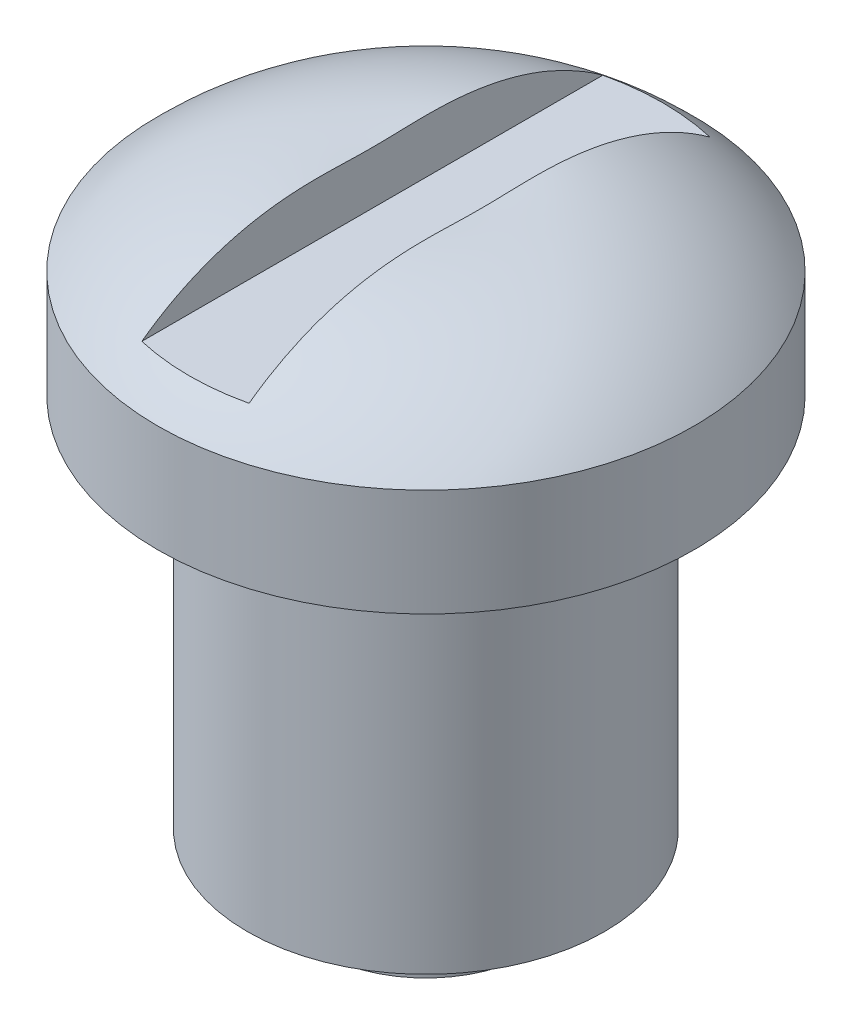
ISO-10303-21;
HEADER;
FILE_DESCRIPTION(('STEP AP214'),'2;1');
FILE_NAME('part.step','',(''),(''),'','','');
FILE_SCHEMA(('AUTOMOTIVE_DESIGN { 1 0 10303 214 1 1 1 1 }'));
ENDSEC;
DATA;
#1=APPLICATION_CONTEXT('core data for automotive mechanical design processes');
#2=APPLICATION_PROTOCOL_DEFINITION('international standard','automotive_design',2000,#1);
#3=PRODUCT_CONTEXT('',#1,'mechanical');
#4=PRODUCT('Part','Part','',(#3));
#5=PRODUCT_RELATED_PRODUCT_CATEGORY('part','',(#4));
#6=PRODUCT_DEFINITION_FORMATION('','',#4);
#7=PRODUCT_DEFINITION_CONTEXT('part definition',#1,'design');
#8=PRODUCT_DEFINITION('design','',#6,#7);
#9=PRODUCT_DEFINITION_SHAPE('','',#8);
#10=(LENGTH_UNIT() NAMED_UNIT(*) SI_UNIT(.MILLI.,.METRE.));
#11=(NAMED_UNIT(*) PLANE_ANGLE_UNIT() SI_UNIT($,.RADIAN.));
#12=(NAMED_UNIT(*) SI_UNIT($,.STERADIAN.) SOLID_ANGLE_UNIT());
#13=UNCERTAINTY_MEASURE_WITH_UNIT(LENGTH_MEASURE(1.E-05),#10,'distance_accuracy_value','');
#14=(GEOMETRIC_REPRESENTATION_CONTEXT(3) GLOBAL_UNCERTAINTY_ASSIGNED_CONTEXT((#13)) GLOBAL_UNIT_ASSIGNED_CONTEXT((#10,
#11,#12)) REPRESENTATION_CONTEXT('',''));
#15=CARTESIAN_POINT('',(0.,0.,0.));
#16=DIRECTION('',(0.,0.,1.));
#17=DIRECTION('',(1.,0.,0.));
#18=AXIS2_PLACEMENT_3D('',#15,#16,#17);
#19=CARTESIAN_POINT('',(0.,1.51705678998902,0.));
#20=DIRECTION('',(0.,1.,0.));
#21=DIRECTION('',(0.,0.,1.));
#22=AXIS2_PLACEMENT_3D('',#19,#20,#21);
#23=DEGENERATE_TOROIDAL_SURFACE('',#22,1.41264629624588,5.,.T.);
#24=CARTESIAN_POINT('',(0.,5.,0.));
#25=DIRECTION('',(0.,1.,0.));
#26=DIRECTION('',(0.,0.,1.));
#27=AXIS2_PLACEMENT_3D('',#24,#25,#26);
#28=CIRCLE('',#27,5.);
#29=CARTESIAN_POINT('',(0.,5.,5.));
#30=VERTEX_POINT('',#29);
#31=EDGE_CURVE('E116',#30,#30,#28,.T.);
#32=ORIENTED_EDGE('',*,*,#31,.T.);
#33=EDGE_LOOP('',(#32));
#34=FACE_BOUND('',#33,.T.);
#35=CARTESIAN_POINT('',(1.,6.5,0.));
#36=CARTESIAN_POINT('',(1.,6.50000428929014,0.083420987186383));
#37=CARTESIAN_POINT('',(1.,6.50091310297412,0.166842031422464));
#38=CARTESIAN_POINT('',(1.,6.50400245623837,0.333672205487057));
#39=CARTESIAN_POINT('',(1.,6.50618325215456,0.417081329523434));
#40=CARTESIAN_POINT('',(1.,6.51058483821947,0.584013033033165));
#41=CARTESIAN_POINT('',(1.,6.51280567926023,0.667535610733787));
#42=CARTESIAN_POINT('',(1.,6.51605751929749,0.834607283332902));
#43=CARTESIAN_POINT('',(1.,6.51708854501698,0.918156377593679));
#44=CARTESIAN_POINT('',(1.,6.51702292300932,1.08672704487177));
#45=CARTESIAN_POINT('',(1.,6.51588861978802,1.17174872840559));
#46=CARTESIAN_POINT('',(1.,6.51074182722729,1.34171022124032));
#47=CARTESIAN_POINT('',(1.,6.50672935289437,1.42665003096579));
#48=CARTESIAN_POINT('',(1.,6.49538222680373,1.5963096749203));
#49=CARTESIAN_POINT('',(1.,6.48804775011912,1.68102952050507));
#50=CARTESIAN_POINT('',(1.,6.46977557954379,1.85008043325664));
#51=CARTESIAN_POINT('',(1.,6.45883769193728,1.93441147927476));
#52=CARTESIAN_POINT('',(1.,6.42037633974167,2.18623094475183));
#53=CARTESIAN_POINT('',(1.,6.38718339972831,2.35289941171905));
#54=CARTESIAN_POINT('',(1.,6.30500975311721,2.68231674629734));
#55=CARTESIAN_POINT('',(1.,6.25602821462935,2.84506540689087));
#56=CARTESIAN_POINT('',(1.,6.15165988503754,3.13863060855104));
#57=CARTESIAN_POINT('',(1.,6.09865173744313,3.27029641792875));
#58=CARTESIAN_POINT('',(1.,5.98182142398355,3.52879260778567));
#59=CARTESIAN_POINT('',(1.,5.91799636284731,3.65562168249405));
#60=CARTESIAN_POINT('',(1.,5.77981528879062,3.90359825368464));
#61=CARTESIAN_POINT('',(1.,5.70544734443971,4.02473910311308));
#62=CARTESIAN_POINT('',(1.,5.54667507092116,4.2603208674841));
#63=CARTESIAN_POINT('',(1.,5.46226714474613,4.37475935913765));
#64=CARTESIAN_POINT('',(1.,5.28400238202402,4.59603141971411));
#65=CARTESIAN_POINT('',(1.,5.1901452372631,4.70286474037801));
#66=CARTESIAN_POINT('',(1.,4.99360392788067,4.90815590142623));
#67=CARTESIAN_POINT('',(1.,4.89091645482418,5.00661057487586));
#68=CARTESIAN_POINT('',(1.,4.67758264573563,5.19426483768728));
#69=CARTESIAN_POINT('',(1.,4.56694411938434,5.28347330402824));
#70=CARTESIAN_POINT('',(1.,4.33838198896765,5.452101779492));
#71=CARTESIAN_POINT('',(1.,4.2204557238358,5.5315181810283));
#72=CARTESIAN_POINT('',(1.,3.98017293724492,5.67872176540839));
#73=CARTESIAN_POINT('',(1.,3.85791933638178,5.74667672100098));
#74=CARTESIAN_POINT('',(1.,3.60808911660614,5.87201560261532));
#75=CARTESIAN_POINT('',(1.,3.48051054154856,5.92939560122269));
#76=CARTESIAN_POINT('',(1.,3.09122460061964,6.08495424839281));
#77=CARTESIAN_POINT('',(1.,2.82273275921775,6.16669478366069));
#78=CARTESIAN_POINT('',(1.,2.27722046404509,6.2832668468889));
#79=CARTESIAN_POINT('',(1.,2.00025173154913,6.31834054889319));
#80=CARTESIAN_POINT('',(1.,1.58356336083551,6.33571329254826));
#81=CARTESIAN_POINT('',(1.,1.44438260237298,6.33562123897453));
#82=CARTESIAN_POINT('',(1.,1.16654236399412,6.32370026985163));
#83=CARTESIAN_POINT('',(1.,1.0278827084639,6.31187574738347));
#84=CARTESIAN_POINT('',(1.,0.752181783949142,6.27658776715776));
#85=CARTESIAN_POINT('',(1.,0.615139236530043,6.25313423623613));
#86=CARTESIAN_POINT('',(1.,0.343565162506595,6.1947759285954));
#87=CARTESIAN_POINT('',(1.,0.209032726297635,6.15987538865947));
#88=CARTESIAN_POINT('',(1.,-0.0566133290452373,6.07887286903077));
#89=CARTESIAN_POINT('',(1.,-0.187727005774608,6.03277107817938));
#90=CARTESIAN_POINT('',(1.,-0.445562969398245,5.92971787946228));
#91=CARTESIAN_POINT('',(1.,-0.572286848359769,5.87277045476753));
#92=CARTESIAN_POINT('',(1.,-0.820577689872625,5.74838672810077));
#93=CARTESIAN_POINT('',(1.,-0.942141354161436,5.68094384248534));
#94=CARTESIAN_POINT('',(1.,-1.17912842507837,5.53610893428252));
#95=CARTESIAN_POINT('',(1.,-1.29455405048957,5.45872054184593));
#96=CARTESIAN_POINT('',(1.,-1.51867764144575,5.2944080713057));
#97=CARTESIAN_POINT('',(1.,-1.62736503997416,5.20746958016896));
#98=CARTESIAN_POINT('',(1.,-1.83702626912959,5.02481593495157));
#99=CARTESIAN_POINT('',(1.,-1.93800285820959,4.92910394670606));
#100=CARTESIAN_POINT('',(1.,-2.13201483906012,4.72913413933789));
#101=CARTESIAN_POINT('',(1.,-2.22501382062827,4.62484099608847));
#102=CARTESIAN_POINT('',(1.,-2.40195335055421,4.40882359393376));
#103=CARTESIAN_POINT('',(1.,-2.48589324645339,4.29709880071738));
#104=CARTESIAN_POINT('',(1.,-2.64394111208469,4.06735179131938));
#105=CARTESIAN_POINT('',(1.,-2.71807537371902,3.9493476560424));
#106=CARTESIAN_POINT('',(1.,-2.85631194892046,3.70764142158825));
#107=CARTESIAN_POINT('',(1.,-2.92041652788847,3.58394061730962));
#108=CARTESIAN_POINT('',(1.,-3.03888326561734,3.33037972900559));
#109=CARTESIAN_POINT('',(1.,-3.09313640716916,3.20046872174312));
#110=CARTESIAN_POINT('',(1.,-3.1908696731439,2.93656942720732));
#111=CARTESIAN_POINT('',(1.,-3.23434276447086,2.80257854180947));
#112=CARTESIAN_POINT('',(1.,-3.31055252377831,2.53105498271427));
#113=CARTESIAN_POINT('',(1.,-3.34325035075226,2.39351138238364));
#114=CARTESIAN_POINT('',(1.,-3.38421038929779,2.18576298307004));
#115=CARTESIAN_POINT('',(1.,-3.39650970926832,2.11632764749956));
#116=CARTESIAN_POINT('',(1.,-3.41849874979281,1.97704260557565));
#117=CARTESIAN_POINT('',(1.,-3.42818841864532,1.90719289104071));
#118=CARTESIAN_POINT('',(1.,-3.4523827448989,1.70620835306679));
#119=CARTESIAN_POINT('',(1.,-3.46373022840942,1.57468530158681));
#120=CARTESIAN_POINT('',(1.,-3.47860674698117,1.31120240679286));
#121=CARTESIAN_POINT('',(1.,-3.48213368456076,1.17924245580327));
#122=CARTESIAN_POINT('',(1.,-3.48316104791721,0.981126372017655));
#123=CARTESIAN_POINT('',(1.,-3.48278946064878,0.914965217758461));
#124=CARTESIAN_POINT('',(1.,-3.48105751522896,0.782654998556594));
#125=CARTESIAN_POINT('',(1.,-3.47969713942208,0.716505933850885));
#126=CARTESIAN_POINT('',(1.,-3.47652596454997,0.58423901012688));
#127=CARTESIAN_POINT('',(1.,-3.47471529135981,0.518121147552588));
#128=CARTESIAN_POINT('',(1.,-3.47127626440574,0.385878119957075));
#129=CARTESIAN_POINT('',(1.,-3.46964791562076,0.319752954785768));
#130=CARTESIAN_POINT('',(1.,-3.46715866549946,0.187086120321612));
#131=CARTESIAN_POINT('',(1.,-3.46630246539632,0.120544350830685));
#132=CARTESIAN_POINT('',(1.,-3.46571125680151,-0.0125426098476535));
#133=CARTESIAN_POINT('',(1.,-3.46597620968813,-0.0790878008382327));
#134=CARTESIAN_POINT('',(1.,-3.46752143648355,-0.212191151258698));
#135=CARTESIAN_POINT('',(1.,-3.46880211378911,-0.278749305334941));
#136=CARTESIAN_POINT('',(1.,-3.47188899710832,-0.411853916067682));
#137=CARTESIAN_POINT('',(1.,-3.47369521996665,-0.478400372280824));
#138=CARTESIAN_POINT('',(1.,-3.47718336330532,-0.611374839253491));
#139=CARTESIAN_POINT('',(1.,-3.47886550563067,-0.677802843462847));
#140=CARTESIAN_POINT('',(1.,-3.48150190059012,-0.810674024043908));
#141=CARTESIAN_POINT('',(1.,-3.48245616743749,-0.877117200094006));
#142=CARTESIAN_POINT('',(1.,-3.48314492523647,-1.0099792455951));
#143=CARTESIAN_POINT('',(1.,-3.48288002845606,-1.07639811049776));
#144=CARTESIAN_POINT('',(1.,-3.48076292636049,-1.20920980692009));
#145=CARTESIAN_POINT('',(1.,-3.47891079003316,-1.27560263944575));
#146=CARTESIAN_POINT('',(1.,-3.47296891972617,-1.4173991242221));
#147=CARTESIAN_POINT('',(1.,-3.4686075449007,-1.49279191271929));
#148=CARTESIAN_POINT('',(1.,-3.45720658991829,-1.64339199382574));
#149=CARTESIAN_POINT('',(1.,-3.45016647642712,-1.71859924649189));
#150=CARTESIAN_POINT('',(1.,-3.43322024602277,-1.86870825877546));
#151=CARTESIAN_POINT('',(1.,-3.42331358408939,-1.94360995754861));
#152=CARTESIAN_POINT('',(1.,-3.40051576064157,-2.09294833165198));
#153=CARTESIAN_POINT('',(1.,-3.38762481536244,-2.16738504027335));
#154=CARTESIAN_POINT('',(1.,-3.34456144688631,-2.38869977284102));
#155=CARTESIAN_POINT('',(1.,-3.3098718213699,-2.53473101426763));
#156=CARTESIAN_POINT('',(1.,-3.22814288449829,-2.8233074983597));
#157=CARTESIAN_POINT('',(1.,-3.18110205218026,-2.9658523093313));
#158=CARTESIAN_POINT('',(1.,-3.07442125700075,-3.24717801658965));
#159=CARTESIAN_POINT('',(1.,-3.01470450396801,-3.38592987419448));
#160=CARTESIAN_POINT('',(1.,-2.88315621917937,-3.65756362746827));
#161=CARTESIAN_POINT('',(1.,-2.81132512036953,-3.79044573269807));
#162=CARTESIAN_POINT('',(1.,-2.65561080008239,-4.04990949104974));
#163=CARTESIAN_POINT('',(1.,-2.57166598437846,-4.17645419946633));
#164=CARTESIAN_POINT('',(1.,-2.39259928437873,-4.42144877975248));
#165=CARTESIAN_POINT('',(1.,-2.29747333491551,-4.53989568256293));
#166=CARTESIAN_POINT('',(1.,-2.10319140951508,-4.76039280524797));
#167=CARTESIAN_POINT('',(1.,-2.00467402356525,-4.8630065319299));
#168=CARTESIAN_POINT('',(1.,-1.79917614180787,-5.05945878446381));
#169=CARTESIAN_POINT('',(1.,-1.69219268337976,-5.15329421314453));
#170=CARTESIAN_POINT('',(1.,-1.47086441308145,-5.33119796930305));
#171=CARTESIAN_POINT('',(1.,-1.35654008411699,-5.41529178239635));
#172=CARTESIAN_POINT('',(1.,-1.12105936617848,-5.57339943680344));
#173=CARTESIAN_POINT('',(1.,-0.999900497337011,-5.64740958562573));
#174=CARTESIAN_POINT('',(1.,-0.753680370771577,-5.78364689952763));
#175=CARTESIAN_POINT('',(1.,-0.62871357983107,-5.84604486661392));
#176=CARTESIAN_POINT('',(1.,-0.373905118109332,-5.96007461759067));
#177=CARTESIAN_POINT('',(1.,-0.244061683187015,-6.01170246021452));
#178=CARTESIAN_POINT('',(1.,0.0195665619416817,-6.10379926398116));
#179=CARTESIAN_POINT('',(1.,0.15335251056975,-6.14426496634881));
#180=CARTESIAN_POINT('',(1.,0.423920654026469,-6.21373482479486));
#181=CARTESIAN_POINT('',(1.,0.56070393234774,-6.24273476154202));
#182=CARTESIAN_POINT('',(1.,0.835547304496381,-6.28892412157904));
#183=CARTESIAN_POINT('',(1.,0.973597612522536,-6.30617179461574));
#184=CARTESIAN_POINT('',(1.,1.25070926375425,-6.32896807177781));
#185=CARTESIAN_POINT('',(1.,1.38977094069383,-6.33451262029751));
#186=CARTESIAN_POINT('',(1.,1.66781282370068,-6.33385047872062));
#187=CARTESIAN_POINT('',(1.,1.806793040554,-6.32764829716523));
#188=CARTESIAN_POINT('',(1.,2.08373545993456,-6.30354650396961));
#189=CARTESIAN_POINT('',(1.,2.2216976626674,-6.28564689469187));
#190=CARTESIAN_POINT('',(1.,2.49550416669812,-6.23830014103342));
#191=CARTESIAN_POINT('',(1.,2.63135018193007,-6.20886290738272));
#192=CARTESIAN_POINT('',(1.,2.90003390628033,-6.13866534650204));
#193=CARTESIAN_POINT('',(1.,3.03287264306463,-6.09790895247832));
#194=CARTESIAN_POINT('',(1.,3.2947074161288,-6.00534247611581));
#195=CARTESIAN_POINT('',(1.,3.42370172497925,-5.95352750765211));
#196=CARTESIAN_POINT('',(1.,3.6768273444197,-5.83924992759235));
#197=CARTESIAN_POINT('',(1.,3.80096041073037,-5.77679120460965));
#198=CARTESIAN_POINT('',(1.,4.04370096083198,-5.64157355933311));
#199=CARTESIAN_POINT('',(1.,4.16230084545927,-5.56880099537768));
#200=CARTESIAN_POINT('',(1.,4.39292202347964,-5.41357361770342));
#201=CARTESIAN_POINT('',(1.,4.50494569471628,-5.33112233639161));
#202=CARTESIAN_POINT('',(1.,4.72170036266886,-5.15709602402312));
#203=CARTESIAN_POINT('',(1.,4.82643000160547,-5.06551930194276));
#204=CARTESIAN_POINT('',(1.,5.02781474944859,-4.87395127537033));
#205=CARTESIAN_POINT('',(1.,5.12447274137665,-4.77396300114429));
#206=CARTESIAN_POINT('',(1.,5.30948206347198,-4.56583569399172));
#207=CARTESIAN_POINT('',(1.,5.39779746631749,-4.45766472634999));
#208=CARTESIAN_POINT('',(1.,5.56505091261534,-4.23436230356964));
#209=CARTESIAN_POINT('',(1.,5.64399223299753,-4.11923330213736));
#210=CARTESIAN_POINT('',(1.,5.79209206267415,-3.88271811689668));
#211=CARTESIAN_POINT('',(1.,5.8612425943311,-3.76132693922429));
#212=CARTESIAN_POINT('',(1.,5.98925931845589,-3.51329228720277));
#213=CARTESIAN_POINT('',(1.,6.04812890705692,-3.38665056445164));
#214=CARTESIAN_POINT('',(1.,6.15605398083444,-3.12723259190719));
#215=CARTESIAN_POINT('',(1.,6.20496520219862,-2.99439635895122));
#216=CARTESIAN_POINT('',(1.,6.29181296628284,-2.72518148296987));
#217=CARTESIAN_POINT('',(1.,6.3297488040481,-2.58880261301185));
#218=CARTESIAN_POINT('',(1.,6.39464718759211,-2.31372952585182));
#219=CARTESIAN_POINT('',(1.,6.42162941026382,-2.17503993054426));
#220=CARTESIAN_POINT('',(1.,6.46509638392724,-1.8960783368926));
#221=CARTESIAN_POINT('',(1.,6.48158369188971,-1.75580673247026));
#222=CARTESIAN_POINT('',(1.,6.504441835187,-1.480967576334));
#223=CARTESIAN_POINT('',(1.,6.51124310523523,-1.34643442286571));
#224=CARTESIAN_POINT('',(1.,6.51619408532225,-1.14451922375811));
#225=CARTESIAN_POINT('',(1.,6.51696890066567,-1.07718191907158));
#226=CARTESIAN_POINT('',(1.,6.51713007717958,-0.942504809551761));
#227=CARTESIAN_POINT('',(1.,6.51651641967869,-0.87516500469702));
#228=CARTESIAN_POINT('',(1.,6.51436498275994,-0.740496018900719));
#229=CARTESIAN_POINT('',(1.,6.51282710272355,-0.673166839914397));
#230=CARTESIAN_POINT('',(1.,6.50942686989943,-0.5385164992139));
#231=CARTESIAN_POINT('',(1.,6.50756451207002,-0.471195337640565));
#232=CARTESIAN_POINT('',(1.,6.50419074449169,-0.33656857589368));
#233=CARTESIAN_POINT('',(1.,6.50267920227137,-0.269262979465042));
#234=CARTESIAN_POINT('',(1.,6.50058212012722,-0.134638267246336));
#235=CARTESIAN_POINT('',(1.,6.49999653862433,-0.0673191521990727));
#236=CARTESIAN_POINT('',(1.,6.5,0.));
#237=B_SPLINE_CURVE_WITH_KNOTS('',3,(#35,#36,#37,#38,#39,#40,#41,#42,#43,#44,#45,#46,#47,#48,
#49,#50,#51,#52,#53,#54,#55,#56,#57,#58,#59,#60,#61,#62,#63,#64,#65,#66,#67,#68,#69,#70,#71,#72,
#73,#74,#75,#76,#77,#78,#79,#80,#81,#82,#83,#84,#85,#86,#87,#88,#89,#90,#91,#92,#93,#94,#95,#96,
#97,#98,#99,#100,#101,#102,#103,#104,#105,#106,#107,#108,#109,#110,#111,#112,#113,#114,#115,
#116,#117,#118,#119,#120,#121,#122,#123,#124,#125,#126,#127,#128,#129,#130,#131,#132,#133,#134,
#135,#136,#137,#138,#139,#140,#141,#142,#143,#144,#145,#146,#147,#148,#149,#150,#151,#152,#153,
#154,#155,#156,#157,#158,#159,#160,#161,#162,#163,#164,#165,#166,#167,#168,#169,#170,#171,#172,
#173,#174,#175,#176,#177,#178,#179,#180,#181,#182,#183,#184,#185,#186,#187,#188,#189,#190,#191,
#192,#193,#194,#195,#196,#197,#198,#199,#200,#201,#202,#203,#204,#205,#206,#207,#208,#209,#210,
#211,#212,#213,#214,#215,#216,#217,#218,#219,#220,#221,#222,#223,#224,#225,#226,#227,#228,#229,
#230,#231,#232,#233,#234,#235,#236),.UNSPECIFIED.,.T.,.F.,(4,2,2,2,2,2,2,2,2,2,2,2,2,2,2,2,2,2,
2,2,2,2,2,2,2,2,2,2,2,2,2,2,2,2,2,2,2,2,2,2,2,2,2,2,2,2,2,2,2,2,2,2,2,2,2,2,2,2,2,2,2,2,2,2,2,2,
2,2,2,2,2,2,2,2,2,2,2,2,2,2,2,2,2,2,2,2,2,2,2,2,2,2,2,2,2,2,2,2,2,2,4),(0.,0.250260778827922,
0.500572008834353,0.751227586390458,1.00187753416851,1.25692607191361,1.51197327987085,
1.76700704812797,2.02205452898367,2.53109005751316,3.04015241115143,3.46548470517126,
3.89093102458207,4.316862725279,4.74294748606151,5.16904614934814,5.59530515929123,
6.02115106557522,6.44715339591255,6.86624406937352,7.28549007589349,8.12316894329086,
8.95648356036871,9.37361111213737,9.79058253446029,10.2071986299107,10.6236607005012,
11.0401157504628,11.4564181469254,11.872982744089,12.2893957230291,12.7064460194853,
13.1233464151946,13.542058212892,13.9608001471907,14.3783955054935,14.7958964050867,
15.2177680444804,15.6399142005105,16.0635658100453,16.2750724739761,16.4865833278911,
16.8823209919634,17.2781647806133,17.4766453100043,17.6751293834866,17.8735580354388,
18.0719921047828,18.2716263408832,18.4712536999992,18.6709603812002,18.8706734640661,
19.0700203583546,19.2693633598851,19.4686062616322,19.667840503919,19.8943528779762,
20.1209103740428,20.3475109740865,20.5740951602309,21.0238071080757,21.4735744607259,
21.926148483488,22.3787063354524,22.8336521523374,23.2887638902407,23.7150011341754,
24.1413882009837,24.5666332984538,24.9920336983736,25.4105724708888,25.8292641376789,
26.2480779119979,26.6670456640809,27.0839214075174,27.5009415915463,27.917801750474,
28.3346618252098,28.7511646023981,29.1675228329913,29.5840654097344,30.0004561308511,
30.4174028244322,30.8341978168278,31.251070189107,31.6677930207846,32.0862356418317,
32.5045315531491,32.9231663587376,33.3416626128422,33.7658468775897,34.1900583818749,
34.613504431145,35.0368472729058,35.440718110419,35.6427314389147,35.8447474839842,
36.046785526181,36.2488267078949,36.4507914722929,36.6527471674674),.UNSPECIFIED.);
#238=CARTESIAN_POINT('',(1.,5.51705678998902,-4.29784217204082));
#239=VERTEX_POINT('',#238);
#240=CARTESIAN_POINT('',(1.,5.51705678998902,4.29784217204082));
#241=VERTEX_POINT('',#240);
#242=EDGE_CURVE('E47',#239,#241,#237,.T.);
#243=ORIENTED_EDGE('',*,*,#242,.T.);
#244=CARTESIAN_POINT('',(0.,5.51705678998902,0.));
#245=DIRECTION('',(0.,-1.,0.));
#246=DIRECTION('',(0.,0.,-1.));
#247=AXIS2_PLACEMENT_3D('',#244,#245,#246);
#248=CIRCLE('',#247,4.41264629624588);
#249=CARTESIAN_POINT('',(-1.,5.51705678998902,4.29784217204082));
#250=VERTEX_POINT('',#249);
#251=EDGE_CURVE('E11',#241,#250,#248,.T.);
#252=ORIENTED_EDGE('',*,*,#251,.T.);
#253=CARTESIAN_POINT('',(-1.,6.5,0.));
#254=CARTESIAN_POINT('',(-1.,6.50000428929014,-0.0834209871863831));
#255=CARTESIAN_POINT('',(-1.,6.50091310297412,-0.166842031422464));
#256=CARTESIAN_POINT('',(-1.,6.50400245623837,-0.333672205487057));
#257=CARTESIAN_POINT('',(-1.,6.50618325215456,-0.417081329523434));
#258=CARTESIAN_POINT('',(-1.,6.51058483821947,-0.584013033033165));
#259=CARTESIAN_POINT('',(-1.,6.51280567926023,-0.667535610733787));
#260=CARTESIAN_POINT('',(-1.,6.51605751929749,-0.834607283332902));
#261=CARTESIAN_POINT('',(-1.,6.51708854501698,-0.918156377593679));
#262=CARTESIAN_POINT('',(-1.,6.51702292300932,-1.08672704487177));
#263=CARTESIAN_POINT('',(-1.,6.51588861978802,-1.17174872840559));
#264=CARTESIAN_POINT('',(-1.,6.51074182722729,-1.34171022124032));
#265=CARTESIAN_POINT('',(-1.,6.50672935289437,-1.42665003096579));
#266=CARTESIAN_POINT('',(-1.,6.49538222680373,-1.5963096749203));
#267=CARTESIAN_POINT('',(-1.,6.48804775011912,-1.68102952050507));
#268=CARTESIAN_POINT('',(-1.,6.46977557954379,-1.85008043325664));
#269=CARTESIAN_POINT('',(-1.,6.45883769193728,-1.93441147927476));
#270=CARTESIAN_POINT('',(-1.,6.42037633974167,-2.18623094475183));
#271=CARTESIAN_POINT('',(-1.,6.38718339972831,-2.35289941171905));
#272=CARTESIAN_POINT('',(-1.,6.30500975311721,-2.68231674629734));
#273=CARTESIAN_POINT('',(-1.,6.25602821462935,-2.84506540689087));
#274=CARTESIAN_POINT('',(-1.,6.15165988503754,-3.13863060855104));
#275=CARTESIAN_POINT('',(-1.,6.09865173744313,-3.27029641792875));
#276=CARTESIAN_POINT('',(-1.,5.98182142398355,-3.52879260778567));
#277=CARTESIAN_POINT('',(-1.,5.91799636284731,-3.65562168249405));
#278=CARTESIAN_POINT('',(-1.,5.77981528879062,-3.90359825368464));
#279=CARTESIAN_POINT('',(-1.,5.70544734443971,-4.02473910311308));
#280=CARTESIAN_POINT('',(-1.,5.54667507092116,-4.2603208674841));
#281=CARTESIAN_POINT('',(-1.,5.46226714474613,-4.37475935913765));
#282=CARTESIAN_POINT('',(-1.,5.28400238202402,-4.59603141971411));
#283=CARTESIAN_POINT('',(-1.,5.1901452372631,-4.70286474037801));
#284=CARTESIAN_POINT('',(-1.,4.99360392788067,-4.90815590142623));
#285=CARTESIAN_POINT('',(-1.,4.89091645482418,-5.00661057487586));
#286=CARTESIAN_POINT('',(-1.,4.67758264573563,-5.19426483768729));
#287=CARTESIAN_POINT('',(-1.,4.56694411938434,-5.28347330402824));
#288=CARTESIAN_POINT('',(-1.,4.33838198896765,-5.452101779492));
#289=CARTESIAN_POINT('',(-1.,4.2204557238358,-5.5315181810283));
#290=CARTESIAN_POINT('',(-1.,3.98017293724492,-5.67872176540839));
#291=CARTESIAN_POINT('',(-0.999999999999999,3.85791933638178,-5.74667672100098));
#292=CARTESIAN_POINT('',(-0.999999999999999,3.60808911660614,-5.87201560261532));
#293=CARTESIAN_POINT('',(-0.999999999999999,3.48051054154856,-5.9293956012227));
#294=CARTESIAN_POINT('',(-0.999999999999999,3.09122460061964,-6.08495424839281));
#295=CARTESIAN_POINT('',(-0.999999999999999,2.82273275921775,-6.16669478366069));
#296=CARTESIAN_POINT('',(-0.999999999999999,2.27722046404509,-6.2832668468889));
#297=CARTESIAN_POINT('',(-0.999999999999999,2.00025173154913,-6.31834054889319));
#298=CARTESIAN_POINT('',(-0.999999999999999,1.58356336083551,-6.33571329254825));
#299=CARTESIAN_POINT('',(-0.999999999999999,1.44438260237298,-6.33562123897453));
#300=CARTESIAN_POINT('',(-0.999999999999999,1.16654236399412,-6.32370026985163));
#301=CARTESIAN_POINT('',(-0.999999999999999,1.02788270846391,-6.31187574738347));
#302=CARTESIAN_POINT('',(-0.999999999999999,0.752181783949143,-6.27658776715776));
#303=CARTESIAN_POINT('',(-0.999999999999999,0.615139236530044,-6.25313423623613));
#304=CARTESIAN_POINT('',(-0.999999999999999,0.343565162506596,-6.1947759285954));
#305=CARTESIAN_POINT('',(-0.999999999999999,0.209032726297636,-6.15987538865947));
#306=CARTESIAN_POINT('',(-0.999999999999999,-0.0566133290452371,-6.07887286903077));
#307=CARTESIAN_POINT('',(-0.999999999999999,-0.187727005774608,-6.03277107817938));
#308=CARTESIAN_POINT('',(-0.999999999999999,-0.445562969398245,-5.92971787946228));
#309=CARTESIAN_POINT('',(-0.999999999999999,-0.572286848359769,-5.87277045476753));
#310=CARTESIAN_POINT('',(-0.999999999999999,-0.820577689872626,-5.74838672810077));
#311=CARTESIAN_POINT('',(-0.999999999999998,-0.942141354161436,-5.68094384248534));
#312=CARTESIAN_POINT('',(-0.999999999999998,-1.17912842507837,-5.53610893428252));
#313=CARTESIAN_POINT('',(-0.999999999999998,-1.29455405048957,-5.45872054184593));
#314=CARTESIAN_POINT('',(-0.999999999999998,-1.51867764144575,-5.2944080713057));
#315=CARTESIAN_POINT('',(-0.999999999999998,-1.62736503997416,-5.20746958016896));
#316=CARTESIAN_POINT('',(-0.999999999999998,-1.83702626912959,-5.02481593495157));
#317=CARTESIAN_POINT('',(-0.999999999999998,-1.93800285820959,-4.92910394670606));
#318=CARTESIAN_POINT('',(-0.999999999999998,-2.13201483906012,-4.72913413933789));
#319=CARTESIAN_POINT('',(-0.999999999999998,-2.22501382062828,-4.62484099608847));
#320=CARTESIAN_POINT('',(-0.999999999999998,-2.40195335055421,-4.40882359393375));
#321=CARTESIAN_POINT('',(-0.999999999999998,-2.48589324645339,-4.29709880071738));
#322=CARTESIAN_POINT('',(-0.999999999999998,-2.64394111208469,-4.06735179131938));
#323=CARTESIAN_POINT('',(-0.999999999999998,-2.71807537371902,-3.9493476560424));
#324=CARTESIAN_POINT('',(-0.999999999999998,-2.85631194892046,-3.70764142158824));
#325=CARTESIAN_POINT('',(-0.999999999999998,-2.92041652788847,-3.58394061730962));
#326=CARTESIAN_POINT('',(-0.999999999999998,-3.03888326561734,-3.33037972900558));
#327=CARTESIAN_POINT('',(-0.999999999999998,-3.09313640716916,-3.20046872174312));
#328=CARTESIAN_POINT('',(-0.999999999999998,-3.1908696731439,-2.93656942720732));
#329=CARTESIAN_POINT('',(-0.999999999999998,-3.23434276447086,-2.80257854180947));
#330=CARTESIAN_POINT('',(-0.999999999999998,-3.31055252377831,-2.53105498271427));
#331=CARTESIAN_POINT('',(-0.999999999999998,-3.34325035075226,-2.39351138238364));
#332=CARTESIAN_POINT('',(-0.999999999999998,-3.38421038929779,-2.18576298307003));
#333=CARTESIAN_POINT('',(-0.999999999999998,-3.39650970926832,-2.11632764749956));
#334=CARTESIAN_POINT('',(-0.999999999999998,-3.41849874979281,-1.97704260557565));
#335=CARTESIAN_POINT('',(-0.999999999999998,-3.42818841864532,-1.90719289104071));
#336=CARTESIAN_POINT('',(-0.999999999999998,-3.4523827448989,-1.70620835306679));
#337=CARTESIAN_POINT('',(-0.999999999999998,-3.46373022840942,-1.57468530158682));
#338=CARTESIAN_POINT('',(-0.999999999999998,-3.47860674698117,-1.31120240679286));
#339=CARTESIAN_POINT('',(-0.999999999999998,-3.48213368456076,-1.17924245580327));
#340=CARTESIAN_POINT('',(-0.999999999999998,-3.48316104791721,-0.981126372017655));
#341=CARTESIAN_POINT('',(-0.999999999999998,-3.48278946064878,-0.914965217758461));
#342=CARTESIAN_POINT('',(-0.999999999999998,-3.48105751522896,-0.782654998556593));
#343=CARTESIAN_POINT('',(-0.999999999999998,-3.47969713942208,-0.716505933850884));
#344=CARTESIAN_POINT('',(-0.999999999999998,-3.47652596454997,-0.584239010126879));
#345=CARTESIAN_POINT('',(-0.999999999999998,-3.47471529135981,-0.518121147552588));
#346=CARTESIAN_POINT('',(-0.999999999999998,-3.47127626440574,-0.385878119957075));
#347=CARTESIAN_POINT('',(-0.999999999999998,-3.46964791562076,-0.319752954785769));
#348=CARTESIAN_POINT('',(-0.999999999999998,-3.46715866549946,-0.187086120321612));
#349=CARTESIAN_POINT('',(-0.999999999999998,-3.46630246539632,-0.120544350830685));
#350=CARTESIAN_POINT('',(-0.999999999999998,-3.46571125680151,0.0125426098476551));
#351=CARTESIAN_POINT('',(-0.999999999999998,-3.46597620968813,0.0790878008382343));
#352=CARTESIAN_POINT('',(-0.999999999999998,-3.46752143648355,0.212191151258698));
#353=CARTESIAN_POINT('',(-0.999999999999998,-3.46880211378911,0.27874930533494));
#354=CARTESIAN_POINT('',(-0.999999999999998,-3.47188899710832,0.41185391606768));
#355=CARTESIAN_POINT('',(-0.999999999999998,-3.47369521996665,0.478400372280822));
#356=CARTESIAN_POINT('',(-0.999999999999998,-3.47718336330532,0.61137483925349));
#357=CARTESIAN_POINT('',(-0.999999999999998,-3.47886550563067,0.677802843462847));
#358=CARTESIAN_POINT('',(-0.999999999999998,-3.48150190059012,0.810674024043909));
#359=CARTESIAN_POINT('',(-0.999999999999998,-3.48245616743749,0.877117200094007));
#360=CARTESIAN_POINT('',(-0.999999999999998,-3.48314492523647,1.0099792455951));
#361=CARTESIAN_POINT('',(-0.999999999999998,-3.48288002845606,1.07639811049776));
#362=CARTESIAN_POINT('',(-0.999999999999998,-3.48076292636049,1.20920980692009));
#363=CARTESIAN_POINT('',(-0.999999999999998,-3.47891079003316,1.27560263944575));
#364=CARTESIAN_POINT('',(-0.999999999999998,-3.47296891972617,1.41739912422209));
#365=CARTESIAN_POINT('',(-0.999999999999998,-3.4686075449007,1.49279191271928));
#366=CARTESIAN_POINT('',(-0.999999999999998,-3.45720658991829,1.64339199382574));
#367=CARTESIAN_POINT('',(-0.999999999999998,-3.45016647642712,1.71859924649189));
#368=CARTESIAN_POINT('',(-0.999999999999998,-3.43322024602277,1.86870825877545));
#369=CARTESIAN_POINT('',(-0.999999999999998,-3.42331358408939,1.9436099575486));
#370=CARTESIAN_POINT('',(-0.999999999999998,-3.40051576064157,2.09294833165198));
#371=CARTESIAN_POINT('',(-0.999999999999998,-3.38762481536244,2.16738504027335));
#372=CARTESIAN_POINT('',(-0.999999999999998,-3.34456144688631,2.38869977284101));
#373=CARTESIAN_POINT('',(-0.999999999999998,-3.30987182136991,2.53473101426763));
#374=CARTESIAN_POINT('',(-0.999999999999998,-3.22814288449829,2.82330749835969));
#375=CARTESIAN_POINT('',(-0.999999999999998,-3.18110205218026,2.9658523093313));
#376=CARTESIAN_POINT('',(-0.999999999999998,-3.07442125700075,3.24717801658965));
#377=CARTESIAN_POINT('',(-0.999999999999998,-3.01470450396801,3.38592987419448));
#378=CARTESIAN_POINT('',(-0.999999999999998,-2.88315621917937,3.65756362746827));
#379=CARTESIAN_POINT('',(-0.999999999999998,-2.81132512036954,3.79044573269806));
#380=CARTESIAN_POINT('',(-0.999999999999998,-2.65561080008239,4.04990949104973));
#381=CARTESIAN_POINT('',(-0.999999999999998,-2.57166598437846,4.17645419946633));
#382=CARTESIAN_POINT('',(-0.999999999999998,-2.39259928437874,4.42144877975248));
#383=CARTESIAN_POINT('',(-0.999999999999998,-2.29747333491551,4.53989568256292));
#384=CARTESIAN_POINT('',(-0.999999999999998,-2.10319140951508,4.76039280524796));
#385=CARTESIAN_POINT('',(-0.999999999999998,-2.00467402356525,4.8630065319299));
#386=CARTESIAN_POINT('',(-0.999999999999998,-1.79917614180788,5.05945878446381));
#387=CARTESIAN_POINT('',(-0.999999999999998,-1.69219268337977,5.15329421314452));
#388=CARTESIAN_POINT('',(-0.999999999999998,-1.47086441308146,5.33119796930305));
#389=CARTESIAN_POINT('',(-0.999999999999998,-1.35654008411699,5.41529178239635));
#390=CARTESIAN_POINT('',(-0.999999999999998,-1.12105936617848,5.57339943680343));
#391=CARTESIAN_POINT('',(-0.999999999999999,-0.999900497337015,5.64740958562573));
#392=CARTESIAN_POINT('',(-0.999999999999999,-0.753680370771582,5.78364689952763));
#393=CARTESIAN_POINT('',(-0.999999999999999,-0.628713579831077,5.84604486661392));
#394=CARTESIAN_POINT('',(-0.999999999999999,-0.373905118109339,5.96007461759067));
#395=CARTESIAN_POINT('',(-0.999999999999999,-0.244061683187022,6.01170246021452));
#396=CARTESIAN_POINT('',(-0.999999999999999,0.0195665619416753,6.10379926398115));
#397=CARTESIAN_POINT('',(-0.999999999999999,0.153352510569745,6.14426496634881));
#398=CARTESIAN_POINT('',(-0.999999999999999,0.423920654026464,6.21373482479486));
#399=CARTESIAN_POINT('',(-0.999999999999999,0.560703932347735,6.24273476154202));
#400=CARTESIAN_POINT('',(-0.999999999999999,0.835547304496376,6.28892412157904));
#401=CARTESIAN_POINT('',(-0.999999999999999,0.973597612522531,6.30617179461574));
#402=CARTESIAN_POINT('',(-0.999999999999999,1.25070926375425,6.32896807177781));
#403=CARTESIAN_POINT('',(-0.999999999999999,1.38977094069382,6.33451262029751));
#404=CARTESIAN_POINT('',(-0.999999999999999,1.66781282370067,6.33385047872062));
#405=CARTESIAN_POINT('',(-0.999999999999999,1.806793040554,6.32764829716523));
#406=CARTESIAN_POINT('',(-0.999999999999999,2.08373545993456,6.30354650396961));
#407=CARTESIAN_POINT('',(-0.999999999999999,2.22169766266739,6.28564689469187));
#408=CARTESIAN_POINT('',(-0.999999999999999,2.49550416669812,6.23830014103342));
#409=CARTESIAN_POINT('',(-0.999999999999999,2.63135018193007,6.20886290738272));
#410=CARTESIAN_POINT('',(-0.999999999999999,2.90003390628033,6.13866534650204));
#411=CARTESIAN_POINT('',(-0.999999999999999,3.03287264306463,6.09790895247832));
#412=CARTESIAN_POINT('',(-0.999999999999999,3.2947074161288,6.00534247611581));
#413=CARTESIAN_POINT('',(-0.999999999999999,3.42370172497925,5.95352750765211));
#414=CARTESIAN_POINT('',(-0.999999999999999,3.6768273444197,5.83924992759235));
#415=CARTESIAN_POINT('',(-0.999999999999999,3.80096041073036,5.77679120460966));
#416=CARTESIAN_POINT('',(-0.999999999999999,4.04370096083198,5.64157355933311));
#417=CARTESIAN_POINT('',(-1.,4.16230084545927,5.56880099537768));
#418=CARTESIAN_POINT('',(-1.,4.39292202347965,5.41357361770342));
#419=CARTESIAN_POINT('',(-1.,4.50494569471628,5.33112233639161));
#420=CARTESIAN_POINT('',(-1.,4.72170036266886,5.15709602402312));
#421=CARTESIAN_POINT('',(-1.,4.82643000160547,5.06551930194276));
#422=CARTESIAN_POINT('',(-1.,5.02781474944859,4.87395127537033));
#423=CARTESIAN_POINT('',(-1.,5.12447274137665,4.77396300114429));
#424=CARTESIAN_POINT('',(-1.,5.30948206347197,4.56583569399172));
#425=CARTESIAN_POINT('',(-1.,5.39779746631749,4.45766472634999));
#426=CARTESIAN_POINT('',(-1.,5.56505091261534,4.23436230356965));
#427=CARTESIAN_POINT('',(-1.,5.64399223299753,4.11923330213736));
#428=CARTESIAN_POINT('',(-1.,5.79209206267415,3.88271811689668));
#429=CARTESIAN_POINT('',(-1.,5.8612425943311,3.7613269392243));
#430=CARTESIAN_POINT('',(-1.,5.98925931845589,3.51329228720277));
#431=CARTESIAN_POINT('',(-1.,6.04812890705692,3.38665056445165));
#432=CARTESIAN_POINT('',(-1.,6.15605398083444,3.12723259190719));
#433=CARTESIAN_POINT('',(-1.,6.20496520219862,2.99439635895122));
#434=CARTESIAN_POINT('',(-1.,6.29181296628284,2.72518148296986));
#435=CARTESIAN_POINT('',(-1.,6.3297488040481,2.58880261301185));
#436=CARTESIAN_POINT('',(-1.,6.39464718759211,2.31372952585182));
#437=CARTESIAN_POINT('',(-1.,6.42162941026382,2.17503993054426));
#438=CARTESIAN_POINT('',(-1.,6.46509638392724,1.8960783368926));
#439=CARTESIAN_POINT('',(-1.,6.48158369188971,1.75580673247027));
#440=CARTESIAN_POINT('',(-1.,6.504441835187,1.48096757633401));
#441=CARTESIAN_POINT('',(-1.,6.51124310523523,1.34643442286571));
#442=CARTESIAN_POINT('',(-1.,6.51619408532225,1.14451922375811));
#443=CARTESIAN_POINT('',(-1.,6.51696890066567,1.07718191907159));
#444=CARTESIAN_POINT('',(-1.,6.51713007717958,0.942504809551766));
#445=CARTESIAN_POINT('',(-1.,6.51651641967869,0.875165004697025));
#446=CARTESIAN_POINT('',(-1.,6.51436498275994,0.740496018900723));
#447=CARTESIAN_POINT('',(-1.,6.51282710272355,0.673166839914399));
#448=CARTESIAN_POINT('',(-1.,6.50942686989943,0.538516499213902));
#449=CARTESIAN_POINT('',(-1.,6.50756451207002,0.471195337640567));
#450=CARTESIAN_POINT('',(-1.,6.50419074449169,0.336568575893682));
#451=CARTESIAN_POINT('',(-1.,6.50267920227137,0.269262979465044));
#452=CARTESIAN_POINT('',(-1.,6.50058212012722,0.134638267246336));
#453=CARTESIAN_POINT('',(-1.,6.49999653862433,0.0673191521990732));
#454=CARTESIAN_POINT('',(-1.,6.5,0.));
#455=B_SPLINE_CURVE_WITH_KNOTS('',3,(#253,#254,#255,#256,#257,#258,#259,#260,#261,#262,#263,
#264,#265,#266,#267,#268,#269,#270,#271,#272,#273,#274,#275,#276,#277,#278,#279,#280,#281,#282,
#283,#284,#285,#286,#287,#288,#289,#290,#291,#292,#293,#294,#295,#296,#297,#298,#299,#300,#301,
#302,#303,#304,#305,#306,#307,#308,#309,#310,#311,#312,#313,#314,#315,#316,#317,#318,#319,#320,
#321,#322,#323,#324,#325,#326,#327,#328,#329,#330,#331,#332,#333,#334,#335,#336,#337,#338,#339,
#340,#341,#342,#343,#344,#345,#346,#347,#348,#349,#350,#351,#352,#353,#354,#355,#356,#357,#358,
#359,#360,#361,#362,#363,#364,#365,#366,#367,#368,#369,#370,#371,#372,#373,#374,#375,#376,#377,
#378,#379,#380,#381,#382,#383,#384,#385,#386,#387,#388,#389,#390,#391,#392,#393,#394,#395,#396,
#397,#398,#399,#400,#401,#402,#403,#404,#405,#406,#407,#408,#409,#410,#411,#412,#413,#414,#415,
#416,#417,#418,#419,#420,#421,#422,#423,#424,#425,#426,#427,#428,#429,#430,#431,#432,#433,#434,
#435,#436,#437,#438,#439,#440,#441,#442,#443,#444,#445,#446,#447,#448,#449,#450,#451,#452,#453,
#454),.UNSPECIFIED.,.T.,.F.,(4,2,2,2,2,2,2,2,2,2,2,2,2,2,2,2,2,2,2,2,2,2,2,2,2,2,2,2,2,2,2,2,2,
2,2,2,2,2,2,2,2,2,2,2,2,2,2,2,2,2,2,2,2,2,2,2,2,2,2,2,2,2,2,2,2,2,2,2,2,2,2,2,2,2,2,2,2,2,2,2,2,
2,2,2,2,2,2,2,2,2,2,2,2,2,2,2,2,2,2,2,4),(0.,0.250260778827922,0.500572008834353,
0.751227586390458,1.00187753416851,1.25692607191361,1.51197327987085,1.76700704812797,
2.02205452898367,2.53109005751316,3.04015241115143,3.46548470517126,3.89093102458207,
4.316862725279,4.74294748606151,5.16904614934814,5.59530515929123,6.02115106557522,
6.44715339591255,6.86624406937352,7.28549007589349,8.12316894329086,8.95648356036871,
9.37361111213736,9.79058253446029,10.2071986299107,10.6236607005012,11.0401157504628,
11.4564181469254,11.872982744089,12.2893957230291,12.7064460194853,13.1233464151946,
13.542058212892,13.9608001471907,14.3783955054935,14.7958964050867,15.2177680444804,
15.6399142005105,16.0635658100453,16.2750724739761,16.4865833278911,16.8823209919634,
17.2781647806133,17.4766453100043,17.6751293834866,17.8735580354388,18.0719921047828,
18.2716263408832,18.4712536999992,18.6709603812002,18.8706734640661,19.0700203583546,
19.2693633598851,19.4686062616322,19.6678405039189,19.8943528779762,20.1209103740428,
20.3475109740865,20.5740951602309,21.0238071080757,21.4735744607259,21.926148483488,
22.3787063354524,22.8336521523374,23.2887638902406,23.7150011341754,24.1413882009837,
24.5666332984538,24.9920336983736,25.4105724708888,25.8292641376788,26.2480779119979,
26.6670456640809,27.0839214075174,27.5009415915463,27.917801750474,28.3346618252098,
28.7511646023981,29.1675228329913,29.5840654097344,30.0004561308511,30.4174028244322,
30.8341978168278,31.251070189107,31.6677930207846,32.0862356418317,32.5045315531491,
32.9231663587376,33.3416626128422,33.7658468775897,34.1900583818749,34.613504431145,
35.0368472729058,35.440718110419,35.6427314389147,35.8447474839842,36.046785526181,
36.2488267078949,36.4507914722929,36.6527471674675),.UNSPECIFIED.);
#456=CARTESIAN_POINT('',(-1.,5.51705678998902,-4.29784217204037));
#457=VERTEX_POINT('',#456);
#458=EDGE_CURVE('E58',#250,#457,#455,.T.);
#459=ORIENTED_EDGE('',*,*,#458,.T.);
#460=EDGE_CURVE('E37',#457,#239,#248,.T.);
#461=ORIENTED_EDGE('',*,*,#460,.T.);
#462=EDGE_LOOP('',(#243,#252,#459,#461));
#463=FACE_BOUND('',#462,.T.);
#464=ADVANCED_FACE('F33',(#34,#463),#23,.T.);
#465=CARTESIAN_POINT('',(2.,-4.,0.));
#466=DIRECTION('',(0.,1.,0.));
#467=DIRECTION('',(0.,0.,1.));
#468=AXIS2_PLACEMENT_3D('',#465,#466,#467);
#469=PLANE('',#468);
#470=CARTESIAN_POINT('',(0.,-4.,0.));
#471=DIRECTION('',(0.,1.,0.));
#472=DIRECTION('',(0.,0.,1.));
#473=AXIS2_PLACEMENT_3D('',#470,#471,#472);
#474=CIRCLE('',#473,3.33);
#475=CARTESIAN_POINT('',(0.,-4.,3.33));
#476=VERTEX_POINT('',#475);
#477=EDGE_CURVE('E191',#476,#476,#474,.T.);
#478=ORIENTED_EDGE('',*,*,#477,.F.);
#479=EDGE_LOOP('',(#478));
#480=FACE_BOUND('',#479,.T.);
#481=CARTESIAN_POINT('',(0.,-4.,0.));
#482=DIRECTION('',(0.,1.,0.));
#483=DIRECTION('',(0.,0.,1.));
#484=AXIS2_PLACEMENT_3D('',#481,#482,#483);
#485=CIRCLE('',#484,2.);
#486=CARTESIAN_POINT('',(0.,-4.,2.));
#487=VERTEX_POINT('',#486);
#488=EDGE_CURVE('E68',#487,#487,#485,.T.);
#489=ORIENTED_EDGE('',*,*,#488,.T.);
#490=EDGE_LOOP('',(#489));
#491=FACE_BOUND('',#490,.T.);
#492=ADVANCED_FACE('F35',(#480,#491),#469,.F.);
#493=CARTESIAN_POINT('',(0.,5.,0.));
#494=DIRECTION('',(0.,1.,0.));
#495=DIRECTION('',(0.,0.,1.));
#496=AXIS2_PLACEMENT_3D('',#493,#494,#495);
#497=CYLINDRICAL_SURFACE('',#496,2.);
#498=ORIENTED_EDGE('',*,*,#488,.F.);
#499=EDGE_LOOP('',(#498));
#500=FACE_BOUND('',#499,.T.);
#501=CARTESIAN_POINT('',(0.,-5.,0.));
#502=DIRECTION('',(0.,1.,0.));
#503=DIRECTION('',(0.,0.,1.));
#504=AXIS2_PLACEMENT_3D('',#501,#502,#503);
#505=CIRCLE('',#504,2.);
#506=CARTESIAN_POINT('',(0.,-5.,2.));
#507=VERTEX_POINT('',#506);
#508=EDGE_CURVE('E117',#507,#507,#505,.T.);
#509=ORIENTED_EDGE('',*,*,#508,.T.);
#510=EDGE_LOOP('',(#509));
#511=FACE_BOUND('',#510,.T.);
#512=ADVANCED_FACE('F105',(#500,#511),#497,.T.);
#513=CARTESIAN_POINT('',(0.,-5.,0.));
#514=DIRECTION('',(0.,1.,0.));
#515=DIRECTION('',(0.,0.,1.));
#516=AXIS2_PLACEMENT_3D('',#513,#514,#515);
#517=PLANE('',#516);
#518=ORIENTED_EDGE('',*,*,#508,.F.);
#519=EDGE_LOOP('',(#518));
#520=FACE_BOUND('',#519,.T.);
#521=ADVANCED_FACE('F100',(#520),#517,.F.);
#522=CARTESIAN_POINT('',(0.,5.,0.));
#523=DIRECTION('',(0.,1.,0.));
#524=DIRECTION('',(0.,0.,1.));
#525=AXIS2_PLACEMENT_3D('',#522,#523,#524);
#526=CYLINDRICAL_SURFACE('',#525,5.);
#527=ORIENTED_EDGE('',*,*,#31,.F.);
#528=EDGE_LOOP('',(#527));
#529=FACE_BOUND('',#528,.T.);
#530=CARTESIAN_POINT('',(0.,3.,0.));
#531=DIRECTION('',(0.,1.,0.));
#532=DIRECTION('',(0.,0.,1.));
#533=AXIS2_PLACEMENT_3D('',#530,#531,#532);
#534=CIRCLE('',#533,5.);
#535=CARTESIAN_POINT('',(0.,3.,5.));
#536=VERTEX_POINT('',#535);
#537=EDGE_CURVE('E118',#536,#536,#534,.T.);
#538=ORIENTED_EDGE('',*,*,#537,.T.);
#539=EDGE_LOOP('',(#538));
#540=FACE_BOUND('',#539,.T.);
#541=ADVANCED_FACE('F97',(#529,#540),#526,.T.);
#542=CARTESIAN_POINT('',(3.33,3.,0.));
#543=DIRECTION('',(0.,1.,0.));
#544=DIRECTION('',(0.,0.,1.));
#545=AXIS2_PLACEMENT_3D('',#542,#543,#544);
#546=PLANE('',#545);
#547=ORIENTED_EDGE('',*,*,#537,.F.);
#548=EDGE_LOOP('',(#547));
#549=FACE_BOUND('',#548,.T.);
#550=CARTESIAN_POINT('',(0.,3.,0.));
#551=DIRECTION('',(0.,1.,0.));
#552=DIRECTION('',(0.,0.,1.));
#553=AXIS2_PLACEMENT_3D('',#550,#551,#552);
#554=CIRCLE('',#553,3.33);
#555=CARTESIAN_POINT('',(0.,3.,3.33));
#556=VERTEX_POINT('',#555);
#557=EDGE_CURVE('E123',#556,#556,#554,.T.);
#558=ORIENTED_EDGE('',*,*,#557,.T.);
#559=EDGE_LOOP('',(#558));
#560=FACE_BOUND('',#559,.T.);
#561=ADVANCED_FACE('F94',(#549,#560),#546,.F.);
#562=CARTESIAN_POINT('',(0.,5.,0.));
#563=DIRECTION('',(0.,1.,0.));
#564=DIRECTION('',(0.,0.,1.));
#565=AXIS2_PLACEMENT_3D('',#562,#563,#564);
#566=CYLINDRICAL_SURFACE('',#565,3.33);
#567=ORIENTED_EDGE('',*,*,#557,.F.);
#568=EDGE_LOOP('',(#567));
#569=FACE_BOUND('',#568,.T.);
#570=ORIENTED_EDGE('',*,*,#477,.T.);
#571=EDGE_LOOP('',(#570));
#572=FACE_BOUND('',#571,.T.);
#573=ADVANCED_FACE('F91',(#569,#572),#566,.T.);
#574=CARTESIAN_POINT('',(-1.,5.51705678998902,-5.));
#575=DIRECTION('',(0.,-1.,0.));
#576=DIRECTION('',(0.,0.,-1.));
#577=AXIS2_PLACEMENT_3D('',#574,#575,#576);
#578=PLANE('',#577);
#579=DIRECTION('',(0.,0.,1.));
#580=VECTOR('',#579,1.);
#581=CARTESIAN_POINT('',(1.,5.51705678998902,-5.));
#582=LINE('',#581,#580);
#583=EDGE_CURVE('E63',#239,#241,#582,.T.);
#584=ORIENTED_EDGE('',*,*,#583,.F.);
#585=ORIENTED_EDGE('',*,*,#460,.F.);
#586=DIRECTION('',(0.,0.,1.));
#587=VECTOR('',#586,1.);
#588=CARTESIAN_POINT('',(-1.,5.51705678998902,-5.));
#589=LINE('',#588,#587);
#590=EDGE_CURVE('E67',#457,#250,#589,.T.);
#591=ORIENTED_EDGE('',*,*,#590,.T.);
#592=ORIENTED_EDGE('',*,*,#251,.F.);
#593=EDGE_LOOP('',(#584,#585,#591,#592));
#594=FACE_BOUND('',#593,.T.);
#595=ADVANCED_FACE('F66',(#594),#578,.F.);
#596=CARTESIAN_POINT('',(1.,5.51705678998902,-5.));
#597=DIRECTION('',(1.,0.,0.));
#598=DIRECTION('',(0.,0.,-1.));
#599=AXIS2_PLACEMENT_3D('',#596,#597,#598);
#600=PLANE('',#599);
#601=ORIENTED_EDGE('',*,*,#242,.F.);
#602=ORIENTED_EDGE('',*,*,#583,.T.);
#603=EDGE_LOOP('',(#601,#602));
#604=FACE_BOUND('',#603,.T.);
#605=ADVANCED_FACE('F87',(#604),#600,.F.);
#606=CARTESIAN_POINT('',(-1.,6.51705678998902,-5.));
#607=DIRECTION('',(-1.,0.,0.));
#608=DIRECTION('',(0.,-1.,0.));
#609=AXIS2_PLACEMENT_3D('',#606,#607,#608);
#610=PLANE('',#609);
#611=ORIENTED_EDGE('',*,*,#458,.F.);
#612=ORIENTED_EDGE('',*,*,#590,.F.);
#613=EDGE_LOOP('',(#611,#612));
#614=FACE_BOUND('',#613,.T.);
#615=ADVANCED_FACE('F69',(#614),#610,.F.);
#616=CLOSED_SHELL('',(#464,#492,#512,#521,#541,#561,#573,#595,#605,#615));
#617=MANIFOLD_SOLID_BREP('B2',#616);
#618=ADVANCED_BREP_SHAPE_REPRESENTATION('',(#18,#617),#14);
#619=SHAPE_DEFINITION_REPRESENTATION(#9,#618);
ENDSEC;
END-ISO-10303-21;
